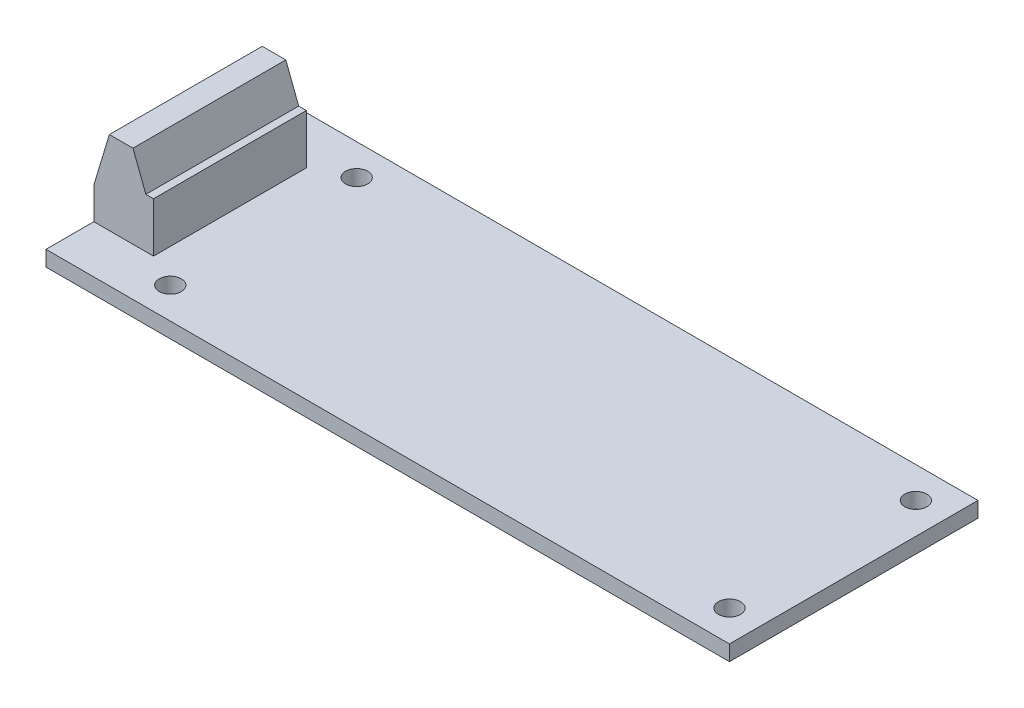
ISO-10303-21;
HEADER;
FILE_DESCRIPTION(('STEP AP214'),'2;1');
FILE_NAME('part.step','',(''),(''),'','','');
FILE_SCHEMA(('AUTOMOTIVE_DESIGN { 1 0 10303 214 1 1 1 1 }'));
ENDSEC;
DATA;
#1=APPLICATION_CONTEXT('core data for automotive mechanical design processes');
#2=APPLICATION_PROTOCOL_DEFINITION('international standard','automotive_design',2000,#1);
#3=PRODUCT_CONTEXT('',#1,'mechanical');
#4=PRODUCT('Part','Part','',(#3));
#5=PRODUCT_RELATED_PRODUCT_CATEGORY('part','',(#4));
#6=PRODUCT_DEFINITION_FORMATION('','',#4);
#7=PRODUCT_DEFINITION_CONTEXT('part definition',#1,'design');
#8=PRODUCT_DEFINITION('design','',#6,#7);
#9=PRODUCT_DEFINITION_SHAPE('','',#8);
#10=(LENGTH_UNIT() NAMED_UNIT(*) SI_UNIT(.MILLI.,.METRE.));
#11=(NAMED_UNIT(*) PLANE_ANGLE_UNIT() SI_UNIT($,.RADIAN.));
#12=(NAMED_UNIT(*) SI_UNIT($,.STERADIAN.) SOLID_ANGLE_UNIT());
#13=UNCERTAINTY_MEASURE_WITH_UNIT(LENGTH_MEASURE(1.E-05),#10,'distance_accuracy_value','');
#14=(GEOMETRIC_REPRESENTATION_CONTEXT(3) GLOBAL_UNCERTAINTY_ASSIGNED_CONTEXT((#13)) GLOBAL_UNIT_ASSIGNED_CONTEXT((#10,
#11,#12)) REPRESENTATION_CONTEXT('',''));
#15=CARTESIAN_POINT('',(0.,0.,0.));
#16=DIRECTION('',(0.,0.,1.));
#17=DIRECTION('',(1.,0.,0.));
#18=AXIS2_PLACEMENT_3D('',#15,#16,#17);
#19=CARTESIAN_POINT('',(0.,1.5748,0.));
#20=DIRECTION('',(0.,-1.,0.));
#21=DIRECTION('',(0.,0.,-1.));
#22=AXIS2_PLACEMENT_3D('',#19,#20,#21);
#23=PLANE('',#22);
#24=CARTESIAN_POINT('',(9.525,1.5748,-22.225));
#25=DIRECTION('',(0.,1.,0.));
#26=DIRECTION('',(0.,0.,1.));
#27=AXIS2_PLACEMENT_3D('',#24,#25,#26);
#28=CIRCLE('',#27,1.13029999999999);
#29=CARTESIAN_POINT('',(9.525,1.5748,-21.0947));
#30=VERTEX_POINT('',#29);
#31=EDGE_CURVE('E120',#30,#30,#28,.T.);
#32=ORIENTED_EDGE('',*,*,#31,.F.);
#33=EDGE_LOOP('',(#32));
#34=FACE_BOUND('',#33,.T.);
#35=CARTESIAN_POINT('',(66.675,1.5748,-3.175));
#36=DIRECTION('',(0.,1.,0.));
#37=DIRECTION('',(0.,0.,1.));
#38=AXIS2_PLACEMENT_3D('',#35,#36,#37);
#39=CIRCLE('',#38,1.13029999999999);
#40=CARTESIAN_POINT('',(66.675,1.5748,-2.04470000000001));
#41=VERTEX_POINT('',#40);
#42=EDGE_CURVE('E183',#41,#41,#39,.T.);
#43=ORIENTED_EDGE('',*,*,#42,.F.);
#44=EDGE_LOOP('',(#43));
#45=FACE_BOUND('',#44,.T.);
#46=CARTESIAN_POINT('',(66.675,1.5748,-22.225));
#47=DIRECTION('',(0.,1.,0.));
#48=DIRECTION('',(0.,0.,1.));
#49=AXIS2_PLACEMENT_3D('',#46,#47,#48);
#50=CIRCLE('',#49,1.13029999999999);
#51=CARTESIAN_POINT('',(66.675,1.5748,-21.0947));
#52=VERTEX_POINT('',#51);
#53=EDGE_CURVE('E189',#52,#52,#50,.T.);
#54=ORIENTED_EDGE('',*,*,#53,.F.);
#55=EDGE_LOOP('',(#54));
#56=FACE_BOUND('',#55,.T.);
#57=DIRECTION('',(0.,0.,1.));
#58=VECTOR('',#57,1.);
#59=CARTESIAN_POINT('',(0.,1.5748,0.));
#60=LINE('',#59,#58);
#61=CARTESIAN_POINT('',(0.,1.5748,-25.4));
#62=VERTEX_POINT('',#61);
#63=CARTESIAN_POINT('',(0.,1.5748,-20.5105));
#64=VERTEX_POINT('',#63);
#65=EDGE_CURVE('E196',#62,#64,#60,.T.);
#66=ORIENTED_EDGE('',*,*,#65,.T.);
#67=DIRECTION('',(1.,0.,0.));
#68=VECTOR('',#67,1.);
#69=CARTESIAN_POINT('',(6.096,1.5748,-20.5105));
#70=LINE('',#69,#68);
#71=CARTESIAN_POINT('',(6.096,1.5748,-20.5105));
#72=VERTEX_POINT('',#71);
#73=EDGE_CURVE('E51',#64,#72,#70,.T.);
#74=ORIENTED_EDGE('',*,*,#73,.T.);
#75=DIRECTION('',(0.,0.,-1.));
#76=VECTOR('',#75,1.);
#77=CARTESIAN_POINT('',(6.096,1.5748,-4.8895));
#78=LINE('',#77,#76);
#79=CARTESIAN_POINT('',(6.096,1.5748,-4.8895));
#80=VERTEX_POINT('',#79);
#81=EDGE_CURVE('E116',#80,#72,#78,.T.);
#82=ORIENTED_EDGE('',*,*,#81,.F.);
#83=DIRECTION('',(1.,0.,0.));
#84=VECTOR('',#83,1.);
#85=CARTESIAN_POINT('',(6.096,1.5748,-4.8895));
#86=LINE('',#85,#84);
#87=CARTESIAN_POINT('',(0.,1.5748,-4.8895));
#88=VERTEX_POINT('',#87);
#89=EDGE_CURVE('E57',#88,#80,#86,.T.);
#90=ORIENTED_EDGE('',*,*,#89,.F.);
#91=CARTESIAN_POINT('',(0.,1.5748,0.));
#92=VERTEX_POINT('',#91);
#93=EDGE_CURVE('E199',#88,#92,#60,.T.);
#94=ORIENTED_EDGE('',*,*,#93,.T.);
#95=DIRECTION('',(1.,0.,0.));
#96=VECTOR('',#95,1.);
#97=CARTESIAN_POINT('',(0.,1.5748,0.));
#98=LINE('',#97,#96);
#99=CARTESIAN_POINT('',(69.85,1.5748,0.));
#100=VERTEX_POINT('',#99);
#101=EDGE_CURVE('E198',#92,#100,#98,.T.);
#102=ORIENTED_EDGE('',*,*,#101,.T.);
#103=DIRECTION('',(0.,0.,-1.));
#104=VECTOR('',#103,1.);
#105=CARTESIAN_POINT('',(69.85,1.5748,0.));
#106=LINE('',#105,#104);
#107=CARTESIAN_POINT('',(69.85,1.5748,-25.4));
#108=VERTEX_POINT('',#107);
#109=EDGE_CURVE('E201',#100,#108,#106,.T.);
#110=ORIENTED_EDGE('',*,*,#109,.T.);
#111=DIRECTION('',(-1.,0.,0.));
#112=VECTOR('',#111,1.);
#113=CARTESIAN_POINT('',(0.,1.5748,-25.4));
#114=LINE('',#113,#112);
#115=EDGE_CURVE('E203',#108,#62,#114,.T.);
#116=ORIENTED_EDGE('',*,*,#115,.T.);
#117=EDGE_LOOP('',(#66,#74,#82,#90,#94,#102,#110,#116));
#118=FACE_BOUND('',#117,.T.);
#119=CARTESIAN_POINT('',(9.525,1.5748,-3.175));
#120=DIRECTION('',(0.,1.,0.));
#121=DIRECTION('',(0.,0.,1.));
#122=AXIS2_PLACEMENT_3D('',#119,#120,#121);
#123=CIRCLE('',#122,1.13029999999999);
#124=CARTESIAN_POINT('',(9.525,1.5748,-2.04470000000001));
#125=VERTEX_POINT('',#124);
#126=EDGE_CURVE('E177',#125,#125,#123,.T.);
#127=ORIENTED_EDGE('',*,*,#126,.F.);
#128=EDGE_LOOP('',(#127));
#129=FACE_BOUND('',#128,.T.);
#130=ADVANCED_FACE('F36',(#34,#45,#56,#118,#129),#23,.F.);
#131=CARTESIAN_POINT('',(0.,1.5748,0.));
#132=DIRECTION('',(1.,0.,0.));
#133=DIRECTION('',(0.,0.,-1.));
#134=AXIS2_PLACEMENT_3D('',#131,#132,#133);
#135=PLANE('',#134);
#136=DIRECTION('',(0.,0.,1.));
#137=VECTOR('',#136,1.);
#138=CARTESIAN_POINT('',(0.,0.,0.));
#139=LINE('',#138,#137);
#140=CARTESIAN_POINT('',(0.,0.,-25.4));
#141=VERTEX_POINT('',#140);
#142=CARTESIAN_POINT('',(0.,0.,0.));
#143=VERTEX_POINT('',#142);
#144=EDGE_CURVE('E195',#141,#143,#139,.T.);
#145=ORIENTED_EDGE('',*,*,#144,.T.);
#146=DIRECTION('',(0.,-1.,0.));
#147=VECTOR('',#146,1.);
#148=CARTESIAN_POINT('',(0.,1.5748,0.));
#149=LINE('',#148,#147);
#150=EDGE_CURVE('E11',#92,#143,#149,.T.);
#151=ORIENTED_EDGE('',*,*,#150,.F.);
#152=ORIENTED_EDGE('',*,*,#93,.F.);
#153=DIRECTION('',(0.,-1.,0.));
#154=VECTOR('',#153,1.);
#155=CARTESIAN_POINT('',(0.,1.5748,-4.8895));
#156=LINE('',#155,#154);
#157=CARTESIAN_POINT('',(0.,4.81790602910337,-4.8895));
#158=VERTEX_POINT('',#157);
#159=EDGE_CURVE('E134',#158,#88,#156,.T.);
#160=ORIENTED_EDGE('',*,*,#159,.F.);
#161=DIRECTION('',(0.,0.,-1.));
#162=VECTOR('',#161,1.);
#163=CARTESIAN_POINT('',(0.,4.81790602910337,-4.8895));
#164=LINE('',#163,#162);
#165=CARTESIAN_POINT('',(0.,4.81790602910337,-20.5105));
#166=VERTEX_POINT('',#165);
#167=EDGE_CURVE('E149',#158,#166,#164,.T.);
#168=ORIENTED_EDGE('',*,*,#167,.T.);
#169=DIRECTION('',(0.,-1.,0.));
#170=VECTOR('',#169,1.);
#171=CARTESIAN_POINT('',(0.,1.5748,-20.5105));
#172=LINE('',#171,#170);
#173=EDGE_CURVE('E135',#166,#64,#172,.T.);
#174=ORIENTED_EDGE('',*,*,#173,.T.);
#175=ORIENTED_EDGE('',*,*,#65,.F.);
#176=DIRECTION('',(0.,-1.,0.));
#177=VECTOR('',#176,1.);
#178=CARTESIAN_POINT('',(0.,1.5748,-25.4));
#179=LINE('',#178,#177);
#180=EDGE_CURVE('E205',#62,#141,#179,.T.);
#181=ORIENTED_EDGE('',*,*,#180,.T.);
#182=EDGE_LOOP('',(#145,#151,#152,#160,#168,#174,#175,#181));
#183=FACE_BOUND('',#182,.T.);
#184=ADVANCED_FACE('F38',(#183),#135,.F.);
#185=CARTESIAN_POINT('',(0.,1.5748,0.));
#186=DIRECTION('',(0.,0.,-1.));
#187=DIRECTION('',(-1.,0.,0.));
#188=AXIS2_PLACEMENT_3D('',#185,#186,#187);
#189=PLANE('',#188);
#190=DIRECTION('',(1.,0.,0.));
#191=VECTOR('',#190,1.);
#192=CARTESIAN_POINT('',(0.,0.,0.));
#193=LINE('',#192,#191);
#194=CARTESIAN_POINT('',(69.85,0.,0.));
#195=VERTEX_POINT('',#194);
#196=EDGE_CURVE('E208',#143,#195,#193,.T.);
#197=ORIENTED_EDGE('',*,*,#196,.T.);
#198=DIRECTION('',(0.,-1.,0.));
#199=VECTOR('',#198,1.);
#200=CARTESIAN_POINT('',(69.85,1.5748,0.));
#201=LINE('',#200,#199);
#202=EDGE_CURVE('E44',#100,#195,#201,.T.);
#203=ORIENTED_EDGE('',*,*,#202,.F.);
#204=ORIENTED_EDGE('',*,*,#101,.F.);
#205=ORIENTED_EDGE('',*,*,#150,.T.);
#206=EDGE_LOOP('',(#197,#203,#204,#205));
#207=FACE_BOUND('',#206,.T.);
#208=ADVANCED_FACE('F239',(#207),#189,.F.);
#209=CARTESIAN_POINT('',(69.85,1.5748,0.));
#210=DIRECTION('',(-1.,0.,0.));
#211=DIRECTION('',(0.,0.,1.));
#212=AXIS2_PLACEMENT_3D('',#209,#210,#211);
#213=PLANE('',#212);
#214=DIRECTION('',(0.,0.,-1.));
#215=VECTOR('',#214,1.);
#216=CARTESIAN_POINT('',(69.85,0.,0.));
#217=LINE('',#216,#215);
#218=CARTESIAN_POINT('',(69.85,0.,-25.4));
#219=VERTEX_POINT('',#218);
#220=EDGE_CURVE('E210',#195,#219,#217,.T.);
#221=ORIENTED_EDGE('',*,*,#220,.T.);
#222=DIRECTION('',(0.,-1.,0.));
#223=VECTOR('',#222,1.);
#224=CARTESIAN_POINT('',(69.85,1.5748,-25.4));
#225=LINE('',#224,#223);
#226=EDGE_CURVE('E216',#108,#219,#225,.T.);
#227=ORIENTED_EDGE('',*,*,#226,.F.);
#228=ORIENTED_EDGE('',*,*,#109,.F.);
#229=ORIENTED_EDGE('',*,*,#202,.T.);
#230=EDGE_LOOP('',(#221,#227,#228,#229));
#231=FACE_BOUND('',#230,.T.);
#232=ADVANCED_FACE('F223',(#231),#213,.F.);
#233=CARTESIAN_POINT('',(0.,1.5748,-25.4));
#234=DIRECTION('',(0.,0.,1.));
#235=DIRECTION('',(1.,0.,0.));
#236=AXIS2_PLACEMENT_3D('',#233,#234,#235);
#237=PLANE('',#236);
#238=DIRECTION('',(-1.,0.,0.));
#239=VECTOR('',#238,1.);
#240=CARTESIAN_POINT('',(0.,0.,-25.4));
#241=LINE('',#240,#239);
#242=EDGE_CURVE('E212',#219,#141,#241,.T.);
#243=ORIENTED_EDGE('',*,*,#242,.T.);
#244=ORIENTED_EDGE('',*,*,#180,.F.);
#245=ORIENTED_EDGE('',*,*,#115,.F.);
#246=ORIENTED_EDGE('',*,*,#226,.T.);
#247=EDGE_LOOP('',(#243,#244,#245,#246));
#248=FACE_BOUND('',#247,.T.);
#249=ADVANCED_FACE('F233',(#248),#237,.F.);
#250=CARTESIAN_POINT('',(0.,0.,0.));
#251=DIRECTION('',(0.,-1.,0.));
#252=DIRECTION('',(0.,0.,-1.));
#253=AXIS2_PLACEMENT_3D('',#250,#251,#252);
#254=PLANE('',#253);
#255=CARTESIAN_POINT('',(9.525,0.,-22.225));
#256=DIRECTION('',(0.,1.,0.));
#257=DIRECTION('',(0.,0.,1.));
#258=AXIS2_PLACEMENT_3D('',#255,#256,#257);
#259=CIRCLE('',#258,1.1303);
#260=CARTESIAN_POINT('',(9.525,0.,-21.0947));
#261=VERTEX_POINT('',#260);
#262=EDGE_CURVE('E174',#261,#261,#259,.T.);
#263=ORIENTED_EDGE('',*,*,#262,.T.);
#264=EDGE_LOOP('',(#263));
#265=FACE_BOUND('',#264,.T.);
#266=CARTESIAN_POINT('',(9.525,0.,-3.175));
#267=DIRECTION('',(0.,1.,0.));
#268=DIRECTION('',(0.,0.,1.));
#269=AXIS2_PLACEMENT_3D('',#266,#267,#268);
#270=CIRCLE('',#269,1.1303);
#271=CARTESIAN_POINT('',(9.525,0.,-2.0447));
#272=VERTEX_POINT('',#271);
#273=EDGE_CURVE('E180',#272,#272,#270,.T.);
#274=ORIENTED_EDGE('',*,*,#273,.T.);
#275=EDGE_LOOP('',(#274));
#276=FACE_BOUND('',#275,.T.);
#277=CARTESIAN_POINT('',(66.675,0.,-3.175));
#278=DIRECTION('',(0.,1.,0.));
#279=DIRECTION('',(0.,0.,1.));
#280=AXIS2_PLACEMENT_3D('',#277,#278,#279);
#281=CIRCLE('',#280,1.1303);
#282=CARTESIAN_POINT('',(66.675,0.,-2.0447));
#283=VERTEX_POINT('',#282);
#284=EDGE_CURVE('E186',#283,#283,#281,.T.);
#285=ORIENTED_EDGE('',*,*,#284,.T.);
#286=EDGE_LOOP('',(#285));
#287=FACE_BOUND('',#286,.T.);
#288=CARTESIAN_POINT('',(66.675,0.,-22.225));
#289=DIRECTION('',(0.,1.,0.));
#290=DIRECTION('',(0.,0.,1.));
#291=AXIS2_PLACEMENT_3D('',#288,#289,#290);
#292=CIRCLE('',#291,1.1303);
#293=CARTESIAN_POINT('',(66.675,0.,-21.0947));
#294=VERTEX_POINT('',#293);
#295=EDGE_CURVE('E192',#294,#294,#292,.T.);
#296=ORIENTED_EDGE('',*,*,#295,.T.);
#297=EDGE_LOOP('',(#296));
#298=FACE_BOUND('',#297,.T.);
#299=ORIENTED_EDGE('',*,*,#144,.F.);
#300=ORIENTED_EDGE('',*,*,#242,.F.);
#301=ORIENTED_EDGE('',*,*,#220,.F.);
#302=ORIENTED_EDGE('',*,*,#196,.F.);
#303=EDGE_LOOP('',(#299,#300,#301,#302));
#304=FACE_BOUND('',#303,.T.);
#305=ADVANCED_FACE('F230',(#265,#276,#287,#298,#304),#254,.T.);
#306=CARTESIAN_POINT('',(66.675,1.5748,-22.225));
#307=DIRECTION('',(0.,1.,0.));
#308=DIRECTION('',(0.,0.,1.));
#309=AXIS2_PLACEMENT_3D('',#306,#307,#308);
#310=CYLINDRICAL_SURFACE('',#309,1.13029999999999);
#311=ORIENTED_EDGE('',*,*,#295,.F.);
#312=EDGE_LOOP('',(#311));
#313=FACE_BOUND('',#312,.T.);
#314=ORIENTED_EDGE('',*,*,#53,.T.);
#315=EDGE_LOOP('',(#314));
#316=FACE_BOUND('',#315,.T.);
#317=ADVANCED_FACE('F280',(#313,#316),#310,.F.);
#318=CARTESIAN_POINT('',(66.675,1.5748,-3.175));
#319=DIRECTION('',(0.,1.,0.));
#320=DIRECTION('',(0.,0.,1.));
#321=AXIS2_PLACEMENT_3D('',#318,#319,#320);
#322=CYLINDRICAL_SURFACE('',#321,1.13029999999999);
#323=ORIENTED_EDGE('',*,*,#284,.F.);
#324=EDGE_LOOP('',(#323));
#325=FACE_BOUND('',#324,.T.);
#326=ORIENTED_EDGE('',*,*,#42,.T.);
#327=EDGE_LOOP('',(#326));
#328=FACE_BOUND('',#327,.T.);
#329=ADVANCED_FACE('F311',(#325,#328),#322,.F.);
#330=CARTESIAN_POINT('',(9.525,1.5748,-3.175));
#331=DIRECTION('',(0.,1.,0.));
#332=DIRECTION('',(0.,0.,1.));
#333=AXIS2_PLACEMENT_3D('',#330,#331,#332);
#334=CYLINDRICAL_SURFACE('',#333,1.13029999999999);
#335=ORIENTED_EDGE('',*,*,#273,.F.);
#336=EDGE_LOOP('',(#335));
#337=FACE_BOUND('',#336,.T.);
#338=ORIENTED_EDGE('',*,*,#126,.T.);
#339=EDGE_LOOP('',(#338));
#340=FACE_BOUND('',#339,.T.);
#341=ADVANCED_FACE('F318',(#337,#340),#334,.F.);
#342=CARTESIAN_POINT('',(9.525,1.5748,-22.225));
#343=DIRECTION('',(0.,1.,0.));
#344=DIRECTION('',(0.,0.,1.));
#345=AXIS2_PLACEMENT_3D('',#342,#343,#344);
#346=CYLINDRICAL_SURFACE('',#345,1.13029999999999);
#347=ORIENTED_EDGE('',*,*,#262,.F.);
#348=EDGE_LOOP('',(#347));
#349=FACE_BOUND('',#348,.T.);
#350=ORIENTED_EDGE('',*,*,#31,.T.);
#351=EDGE_LOOP('',(#350));
#352=FACE_BOUND('',#351,.T.);
#353=ADVANCED_FACE('F325',(#349,#352),#346,.F.);
#354=CARTESIAN_POINT('',(6.096,6.6548,-4.8895));
#355=DIRECTION('',(-1.,0.,0.));
#356=DIRECTION('',(0.,-1.,0.));
#357=AXIS2_PLACEMENT_3D('',#354,#355,#356);
#358=PLANE('',#357);
#359=DIRECTION('',(0.,1.,0.));
#360=VECTOR('',#359,1.);
#361=CARTESIAN_POINT('',(6.096,6.6548,-20.5105));
#362=LINE('',#361,#360);
#363=CARTESIAN_POINT('',(6.096,6.6548,-20.5105));
#364=VERTEX_POINT('',#363);
#365=EDGE_CURVE('E151',#72,#364,#362,.T.);
#366=ORIENTED_EDGE('',*,*,#365,.T.);
#367=DIRECTION('',(0.,0.,-1.));
#368=VECTOR('',#367,1.);
#369=CARTESIAN_POINT('',(6.096,6.6548,-4.8895));
#370=LINE('',#369,#368);
#371=CARTESIAN_POINT('',(6.096,6.6548,-4.8895));
#372=VERTEX_POINT('',#371);
#373=EDGE_CURVE('E121',#372,#364,#370,.T.);
#374=ORIENTED_EDGE('',*,*,#373,.F.);
#375=DIRECTION('',(0.,1.,0.));
#376=VECTOR('',#375,1.);
#377=CARTESIAN_POINT('',(6.096,6.6548,-4.8895));
#378=LINE('',#377,#376);
#379=EDGE_CURVE('E124',#80,#372,#378,.T.);
#380=ORIENTED_EDGE('',*,*,#379,.F.);
#381=ORIENTED_EDGE('',*,*,#81,.T.);
#382=EDGE_LOOP('',(#366,#374,#380,#381));
#383=FACE_BOUND('',#382,.T.);
#384=ADVANCED_FACE('F125',(#383),#358,.F.);
#385=CARTESIAN_POINT('',(5.31497669074277,6.6548,-4.8895));
#386=DIRECTION('',(0.,-1.,0.));
#387=DIRECTION('',(1.,0.,0.));
#388=AXIS2_PLACEMENT_3D('',#385,#386,#387);
#389=PLANE('',#388);
#390=DIRECTION('',(-1.,0.,0.));
#391=VECTOR('',#390,1.);
#392=CARTESIAN_POINT('',(5.31497669074277,6.6548,-20.5105));
#393=LINE('',#392,#391);
#394=CARTESIAN_POINT('',(5.31497669074277,6.6548,-20.5105));
#395=VERTEX_POINT('',#394);
#396=EDGE_CURVE('E153',#364,#395,#393,.T.);
#397=ORIENTED_EDGE('',*,*,#396,.T.);
#398=DIRECTION('',(0.,0.,-1.));
#399=VECTOR('',#398,1.);
#400=CARTESIAN_POINT('',(5.31497669074277,6.6548,-4.8895));
#401=LINE('',#400,#399);
#402=CARTESIAN_POINT('',(5.31497669074277,6.6548,-4.8895));
#403=VERTEX_POINT('',#402);
#404=EDGE_CURVE('E168',#403,#395,#401,.T.);
#405=ORIENTED_EDGE('',*,*,#404,.F.);
#406=DIRECTION('',(-1.,0.,0.));
#407=VECTOR('',#406,1.);
#408=CARTESIAN_POINT('',(5.31497669074277,6.6548,-4.8895));
#409=LINE('',#408,#407);
#410=EDGE_CURVE('E129',#372,#403,#409,.T.);
#411=ORIENTED_EDGE('',*,*,#410,.F.);
#412=ORIENTED_EDGE('',*,*,#373,.T.);
#413=EDGE_LOOP('',(#397,#405,#411,#412));
#414=FACE_BOUND('',#413,.T.);
#415=ADVANCED_FACE('F250',(#414),#389,.F.);
#416=CARTESIAN_POINT('',(3.99952443547425,10.0838,-4.8895));
#417=DIRECTION('',(-0.933654879301528,-0.358173933105759,0.));
#418=DIRECTION('',(0.358173933105759,-0.933654879301528,0.));
#419=AXIS2_PLACEMENT_3D('',#416,#417,#418);
#420=PLANE('',#419);
#421=DIRECTION('',(-0.358173933105759,0.933654879301529,0.));
#422=VECTOR('',#421,1.);
#423=CARTESIAN_POINT('',(3.99952443547425,10.0838,-20.5105));
#424=LINE('',#423,#422);
#425=CARTESIAN_POINT('',(3.99952443547425,10.0838,-20.5105));
#426=VERTEX_POINT('',#425);
#427=EDGE_CURVE('E155',#395,#426,#424,.T.);
#428=ORIENTED_EDGE('',*,*,#427,.T.);
#429=DIRECTION('',(0.,0.,-1.));
#430=VECTOR('',#429,1.);
#431=CARTESIAN_POINT('',(3.99952443547425,10.0838,-4.8895));
#432=LINE('',#431,#430);
#433=CARTESIAN_POINT('',(3.99952443547425,10.0838,-4.8895));
#434=VERTEX_POINT('',#433);
#435=EDGE_CURVE('E165',#434,#426,#432,.T.);
#436=ORIENTED_EDGE('',*,*,#435,.F.);
#437=DIRECTION('',(-0.358173933105759,0.933654879301529,0.));
#438=VECTOR('',#437,1.);
#439=CARTESIAN_POINT('',(3.99952443547425,10.0838,-4.8895));
#440=LINE('',#439,#438);
#441=EDGE_CURVE('E142',#403,#434,#440,.T.);
#442=ORIENTED_EDGE('',*,*,#441,.F.);
#443=ORIENTED_EDGE('',*,*,#404,.T.);
#444=EDGE_LOOP('',(#428,#436,#442,#443));
#445=FACE_BOUND('',#444,.T.);
#446=ADVANCED_FACE('F257',(#445),#420,.F.);
#447=CARTESIAN_POINT('',(1.58847556452574,10.0838,-4.8895));
#448=DIRECTION('',(0.,-1.,0.));
#449=DIRECTION('',(0.,0.,-1.));
#450=AXIS2_PLACEMENT_3D('',#447,#448,#449);
#451=PLANE('',#450);
#452=DIRECTION('',(-1.,0.,0.));
#453=VECTOR('',#452,1.);
#454=CARTESIAN_POINT('',(1.58847556452574,10.0838,-20.5105));
#455=LINE('',#454,#453);
#456=CARTESIAN_POINT('',(1.58847556452574,10.0838,-20.5105));
#457=VERTEX_POINT('',#456);
#458=EDGE_CURVE('E157',#426,#457,#455,.T.);
#459=ORIENTED_EDGE('',*,*,#458,.T.);
#460=DIRECTION('',(0.,0.,-1.));
#461=VECTOR('',#460,1.);
#462=CARTESIAN_POINT('',(1.58847556452574,10.0838,-4.8895));
#463=LINE('',#462,#461);
#464=CARTESIAN_POINT('',(1.58847556452574,10.0838,-4.8895));
#465=VERTEX_POINT('',#464);
#466=EDGE_CURVE('E162',#465,#457,#463,.T.);
#467=ORIENTED_EDGE('',*,*,#466,.F.);
#468=DIRECTION('',(-1.,0.,0.));
#469=VECTOR('',#468,1.);
#470=CARTESIAN_POINT('',(1.58847556452574,10.0838,-4.8895));
#471=LINE('',#470,#469);
#472=EDGE_CURVE('E144',#434,#465,#471,.T.);
#473=ORIENTED_EDGE('',*,*,#472,.F.);
#474=ORIENTED_EDGE('',*,*,#435,.T.);
#475=EDGE_LOOP('',(#459,#467,#473,#474));
#476=FACE_BOUND('',#475,.T.);
#477=ADVANCED_FACE('F259',(#476),#451,.F.);
#478=CARTESIAN_POINT('',(0.,4.81790602910337,-4.8895));
#479=DIRECTION('',(0.957389473161368,-0.288799924999641,0.));
#480=DIRECTION('',(0.288799924999641,0.957389473161368,0.));
#481=AXIS2_PLACEMENT_3D('',#478,#479,#480);
#482=PLANE('',#481);
#483=DIRECTION('',(-0.288799924999641,-0.957389473161368,0.));
#484=VECTOR('',#483,1.);
#485=CARTESIAN_POINT('',(0.,4.81790602910337,-20.5105));
#486=LINE('',#485,#484);
#487=EDGE_CURVE('E138',#457,#166,#486,.T.);
#488=ORIENTED_EDGE('',*,*,#487,.T.);
#489=ORIENTED_EDGE('',*,*,#167,.F.);
#490=DIRECTION('',(-0.288799924999641,-0.957389473161368,0.));
#491=VECTOR('',#490,1.);
#492=CARTESIAN_POINT('',(0.,4.81790602910337,-4.8895));
#493=LINE('',#492,#491);
#494=EDGE_CURVE('E146',#465,#158,#493,.T.);
#495=ORIENTED_EDGE('',*,*,#494,.F.);
#496=ORIENTED_EDGE('',*,*,#466,.T.);
#497=EDGE_LOOP('',(#488,#489,#495,#496));
#498=FACE_BOUND('',#497,.T.);
#499=ADVANCED_FACE('F260',(#498),#482,.F.);
#500=CARTESIAN_POINT('',(0.,0.,-4.8895));
#501=DIRECTION('',(0.,0.,-1.));
#502=DIRECTION('',(-1.,0.,0.));
#503=AXIS2_PLACEMENT_3D('',#500,#501,#502);
#504=PLANE('',#503);
#505=ORIENTED_EDGE('',*,*,#89,.T.);
#506=ORIENTED_EDGE('',*,*,#379,.T.);
#507=ORIENTED_EDGE('',*,*,#410,.T.);
#508=ORIENTED_EDGE('',*,*,#441,.T.);
#509=ORIENTED_EDGE('',*,*,#472,.T.);
#510=ORIENTED_EDGE('',*,*,#494,.T.);
#511=ORIENTED_EDGE('',*,*,#159,.T.);
#512=EDGE_LOOP('',(#505,#506,#507,#508,#509,#510,#511));
#513=FACE_BOUND('',#512,.T.);
#514=ADVANCED_FACE('F132',(#513),#504,.F.);
#515=CARTESIAN_POINT('',(0.,0.,-20.5105));
#516=DIRECTION('',(0.,0.,-1.));
#517=DIRECTION('',(-1.,0.,0.));
#518=AXIS2_PLACEMENT_3D('',#515,#516,#517);
#519=PLANE('',#518);
#520=ORIENTED_EDGE('',*,*,#73,.F.);
#521=ORIENTED_EDGE('',*,*,#173,.F.);
#522=ORIENTED_EDGE('',*,*,#487,.F.);
#523=ORIENTED_EDGE('',*,*,#458,.F.);
#524=ORIENTED_EDGE('',*,*,#427,.F.);
#525=ORIENTED_EDGE('',*,*,#396,.F.);
#526=ORIENTED_EDGE('',*,*,#365,.F.);
#527=EDGE_LOOP('',(#520,#521,#522,#523,#524,#525,#526));
#528=FACE_BOUND('',#527,.T.);
#529=ADVANCED_FACE('F245',(#528),#519,.T.);
#530=CLOSED_SHELL('',(#130,#184,#208,#232,#249,#305,#317,#329,#341,#353,#384,#415,#446,#477,
#499,#514,#529));
#531=MANIFOLD_SOLID_BREP('B2',#530);
#532=ADVANCED_BREP_SHAPE_REPRESENTATION('',(#18,#531),#14);
#533=SHAPE_DEFINITION_REPRESENTATION(#9,#532);
ENDSEC;
END-ISO-10303-21;
